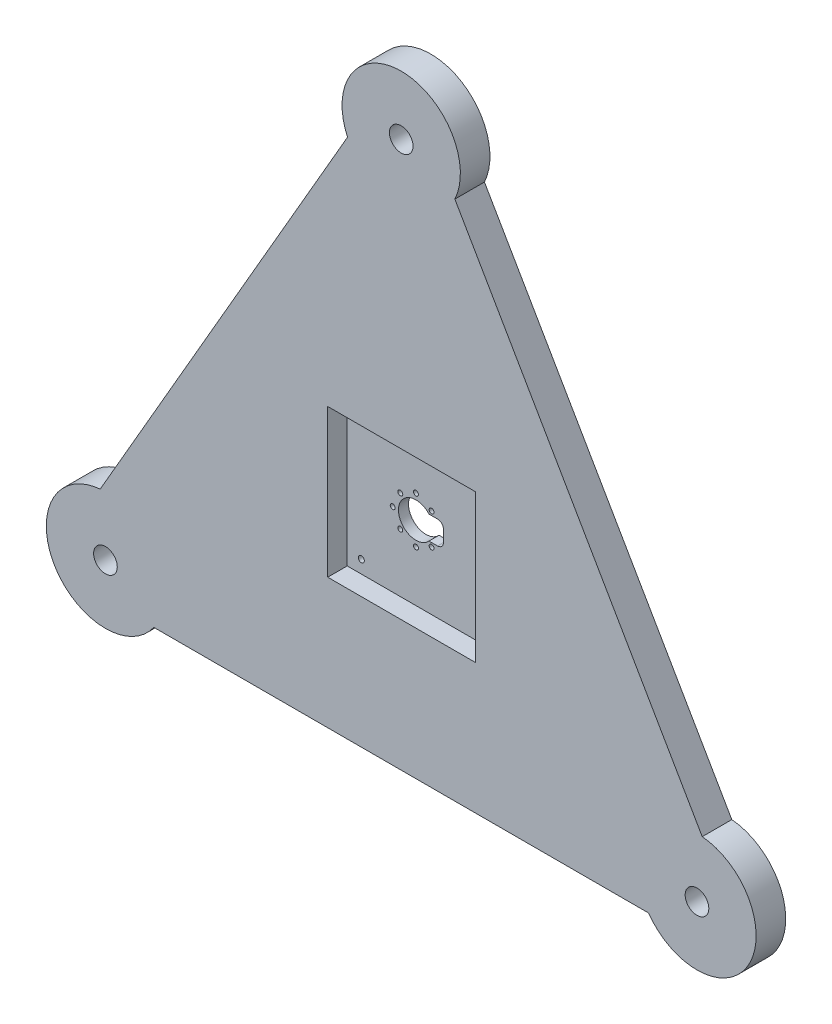
ISO-10303-21;
HEADER;
FILE_DESCRIPTION(('STEP AP214'),'2;1');
FILE_NAME('part.step','',(''),(''),'','','');
FILE_SCHEMA(('AUTOMOTIVE_DESIGN { 1 0 10303 214 1 1 1 1 }'));
ENDSEC;
DATA;
#1=APPLICATION_CONTEXT('core data for automotive mechanical design processes');
#2=APPLICATION_PROTOCOL_DEFINITION('international standard','automotive_design',2000,#1);
#3=PRODUCT_CONTEXT('',#1,'mechanical');
#4=PRODUCT('Part','Part','',(#3));
#5=PRODUCT_RELATED_PRODUCT_CATEGORY('part','',(#4));
#6=PRODUCT_DEFINITION_FORMATION('','',#4);
#7=PRODUCT_DEFINITION_CONTEXT('part definition',#1,'design');
#8=PRODUCT_DEFINITION('design','',#6,#7);
#9=PRODUCT_DEFINITION_SHAPE('','',#8);
#10=(LENGTH_UNIT() NAMED_UNIT(*) SI_UNIT(.MILLI.,.METRE.));
#11=(NAMED_UNIT(*) PLANE_ANGLE_UNIT() SI_UNIT($,.RADIAN.));
#12=(NAMED_UNIT(*) SI_UNIT($,.STERADIAN.) SOLID_ANGLE_UNIT());
#13=UNCERTAINTY_MEASURE_WITH_UNIT(LENGTH_MEASURE(1.E-05),#10,'distance_accuracy_value','');
#14=(GEOMETRIC_REPRESENTATION_CONTEXT(3) GLOBAL_UNCERTAINTY_ASSIGNED_CONTEXT((#13)) GLOBAL_UNIT_ASSIGNED_CONTEXT((#10,
#11,#12)) REPRESENTATION_CONTEXT('',''));
#15=CARTESIAN_POINT('',(0.,0.,0.));
#16=DIRECTION('',(0.,0.,1.));
#17=DIRECTION('',(1.,0.,0.));
#18=AXIS2_PLACEMENT_3D('',#15,#16,#17);
#19=CARTESIAN_POINT('',(0.,0.,0.));
#20=DIRECTION('',(0.,0.,1.));
#21=DIRECTION('',(1.,0.,0.));
#22=AXIS2_PLACEMENT_3D('',#19,#20,#21);
#23=PLANE('',#22);
#24=CARTESIAN_POINT('',(0.,146.646968374165,0.));
#25=DIRECTION('',(0.,0.,1.));
#26=DIRECTION('',(1.,0.,0.));
#27=AXIS2_PLACEMENT_3D('',#24,#25,#26);
#28=CIRCLE('',#27,25.4);
#29=CARTESIAN_POINT('',(23.0384203340171,135.951586730056,0.));
#30=VERTEX_POINT('',#29);
#31=CARTESIAN_POINT('',(-23.038420334017,135.951586730056,0.));
#32=VERTEX_POINT('',#31);
#33=EDGE_CURVE('E377',#30,#32,#28,.T.);
#34=ORIENTED_EDGE('',*,*,#33,.F.);
#35=DIRECTION('',(-0.5,0.866025403784439,0.));
#36=VECTOR('',#35,1.);
#37=CARTESIAN_POINT('',(76.1475791470286,43.9638253186753,0.));
#38=LINE('',#37,#36);
#39=CARTESIAN_POINT('',(129.25673796004,-48.023936092705,0.));
#40=VERTEX_POINT('',#39);
#41=EDGE_CURVE('E388',#40,#30,#38,.T.);
#42=ORIENTED_EDGE('',*,*,#41,.F.);
#43=CARTESIAN_POINT('',(127.,-73.3234841870824,0.));
#44=DIRECTION('',(0.,0.,1.));
#45=DIRECTION('',(1.,0.,0.));
#46=AXIS2_PLACEMENT_3D('',#43,#44,#45);
#47=CIRCLE('',#46,25.4);
#48=CARTESIAN_POINT('',(106.218317626023,-87.9276506373505,0.));
#49=VERTEX_POINT('',#48);
#50=EDGE_CURVE('E386',#49,#40,#47,.T.);
#51=ORIENTED_EDGE('',*,*,#50,.F.);
#52=DIRECTION('',(1.,0.,0.));
#53=VECTOR('',#52,1.);
#54=CARTESIAN_POINT('',(0.,-87.9276506373506,0.));
#55=LINE('',#54,#53);
#56=CARTESIAN_POINT('',(-106.218317626023,-87.9276506373506,0.));
#57=VERTEX_POINT('',#56);
#58=EDGE_CURVE('E384',#57,#49,#55,.T.);
#59=ORIENTED_EDGE('',*,*,#58,.F.);
#60=CARTESIAN_POINT('',(-127.,-73.3234841870825,0.));
#61=DIRECTION('',(0.,0.,1.));
#62=DIRECTION('',(1.,0.,0.));
#63=AXIS2_PLACEMENT_3D('',#60,#61,#62);
#64=CIRCLE('',#63,25.4);
#65=CARTESIAN_POINT('',(-129.25673796004,-48.0239360927051,0.));
#66=VERTEX_POINT('',#65);
#67=EDGE_CURVE('E382',#66,#57,#64,.T.);
#68=ORIENTED_EDGE('',*,*,#67,.F.);
#69=DIRECTION('',(-0.5,-0.866025403784439,0.));
#70=VECTOR('',#69,1.);
#71=CARTESIAN_POINT('',(-76.1475791470286,43.9638253186753,0.));
#72=LINE('',#71,#70);
#73=EDGE_CURVE('E380',#32,#66,#72,.T.);
#74=ORIENTED_EDGE('',*,*,#73,.F.);
#75=EDGE_LOOP('',(#34,#42,#51,#59,#68,#74));
#76=FACE_BOUND('',#75,.T.);
#77=CARTESIAN_POINT('',(127.,-73.3234841870824,0.));
#78=DIRECTION('',(0.,0.,1.));
#79=DIRECTION('',(1.,0.,0.));
#80=AXIS2_PLACEMENT_3D('',#77,#78,#79);
#81=CIRCLE('',#80,5.07999999999999);
#82=CARTESIAN_POINT('',(132.08,-73.3234841870824,0.));
#83=VERTEX_POINT('',#82);
#84=EDGE_CURVE('E341',#83,#83,#81,.T.);
#85=ORIENTED_EDGE('',*,*,#84,.T.);
#86=EDGE_LOOP('',(#85));
#87=FACE_BOUND('',#86,.T.);
#88=CARTESIAN_POINT('',(0.,146.646968374165,0.));
#89=DIRECTION('',(0.,0.,1.));
#90=DIRECTION('',(1.,0.,0.));
#91=AXIS2_PLACEMENT_3D('',#88,#89,#90);
#92=CIRCLE('',#91,5.08);
#93=CARTESIAN_POINT('',(5.08000000000002,146.646968374165,0.));
#94=VERTEX_POINT('',#93);
#95=EDGE_CURVE('E352',#94,#94,#92,.T.);
#96=ORIENTED_EDGE('',*,*,#95,.T.);
#97=EDGE_LOOP('',(#96));
#98=FACE_BOUND('',#97,.T.);
#99=CARTESIAN_POINT('',(-127.,-73.3234841870825,0.));
#100=DIRECTION('',(0.,0.,1.));
#101=DIRECTION('',(1.,0.,0.));
#102=AXIS2_PLACEMENT_3D('',#99,#100,#101);
#103=CIRCLE('',#102,5.08000000000001);
#104=CARTESIAN_POINT('',(-121.92,-73.3234841870825,0.));
#105=VERTEX_POINT('',#104);
#106=EDGE_CURVE('E374',#105,#105,#103,.T.);
#107=ORIENTED_EDGE('',*,*,#106,.T.);
#108=EDGE_LOOP('',(#107));
#109=FACE_BOUND('',#108,.T.);
#110=CARTESIAN_POINT('',(27.2308786567688,-26.4093212941394,0.));
#111=DIRECTION('',(0.,0.,1.));
#112=DIRECTION('',(1.,0.,0.));
#113=AXIS2_PLACEMENT_3D('',#110,#111,#112);
#114=CIRCLE('',#113,1.2954);
#115=CARTESIAN_POINT('',(28.5262786567688,-26.4093212941394,0.));
#116=VERTEX_POINT('',#115);
#117=EDGE_CURVE('E312',#116,#116,#114,.T.);
#118=ORIENTED_EDGE('',*,*,#117,.T.);
#119=EDGE_LOOP('',(#118));
#120=FACE_BOUND('',#119,.T.);
#121=CARTESIAN_POINT('',(-25.5113013418665,-26.4093212941394,0.));
#122=DIRECTION('',(0.,0.,1.));
#123=DIRECTION('',(1.,0.,0.));
#124=AXIS2_PLACEMENT_3D('',#121,#122,#123);
#125=CIRCLE('',#124,1.2954);
#126=CARTESIAN_POINT('',(-24.2159013418666,-26.4093212941394,0.));
#127=VERTEX_POINT('',#126);
#128=EDGE_CURVE('E294',#127,#127,#125,.T.);
#129=ORIENTED_EDGE('',*,*,#128,.T.);
#130=EDGE_LOOP('',(#129));
#131=FACE_BOUND('',#130,.T.);
#132=CARTESIAN_POINT('',(-25.5113013418665,26.803242122524,0.));
#133=DIRECTION('',(0.,0.,1.));
#134=DIRECTION('',(1.,0.,0.));
#135=AXIS2_PLACEMENT_3D('',#132,#133,#134);
#136=CIRCLE('',#135,1.2954);
#137=CARTESIAN_POINT('',(-24.2159013418666,26.803242122524,0.));
#138=VERTEX_POINT('',#137);
#139=EDGE_CURVE('E301',#138,#138,#136,.T.);
#140=ORIENTED_EDGE('',*,*,#139,.T.);
#141=EDGE_LOOP('',(#140));
#142=FACE_BOUND('',#141,.T.);
#143=CARTESIAN_POINT('',(27.2308786567688,26.803242122524,0.));
#144=DIRECTION('',(0.,0.,1.));
#145=DIRECTION('',(1.,0.,0.));
#146=AXIS2_PLACEMENT_3D('',#143,#144,#145);
#147=CIRCLE('',#146,1.2954);
#148=CARTESIAN_POINT('',(28.5262786567688,26.803242122524,0.));
#149=VERTEX_POINT('',#148);
#150=EDGE_CURVE('E307',#149,#149,#147,.T.);
#151=ORIENTED_EDGE('',*,*,#150,.T.);
#152=EDGE_LOOP('',(#151));
#153=FACE_BOUND('',#152,.T.);
#154=CARTESIAN_POINT('',(-8.76888262646258,-6.84713313548926,0.));
#155=DIRECTION('',(0.,0.,1.));
#156=DIRECTION('',(1.,0.,0.));
#157=AXIS2_PLACEMENT_3D('',#154,#155,#156);
#158=CIRCLE('',#157,1.05);
#159=CARTESIAN_POINT('',(-7.71888262646258,-6.84713313548926,0.));
#160=VERTEX_POINT('',#159);
#161=EDGE_CURVE('E274',#160,#160,#158,.T.);
#162=ORIENTED_EDGE('',*,*,#161,.T.);
#163=EDGE_LOOP('',(#162));
#164=FACE_BOUND('',#163,.T.);
#165=CARTESIAN_POINT('',(-2.04888262646258,-10.1271331354893,0.));
#166=DIRECTION('',(0.,0.,1.));
#167=DIRECTION('',(1.,0.,0.));
#168=AXIS2_PLACEMENT_3D('',#165,#166,#167);
#169=CIRCLE('',#168,1.06035135268828);
#170=CARTESIAN_POINT('',(-0.988531273774296,-10.1271331354893,0.));
#171=VERTEX_POINT('',#170);
#172=EDGE_CURVE('E280',#171,#171,#169,.T.);
#173=ORIENTED_EDGE('',*,*,#172,.T.);
#174=EDGE_LOOP('',(#173));
#175=FACE_BOUND('',#174,.T.);
#176=CARTESIAN_POINT('',(4.67111737353742,-6.84713313548926,0.));
#177=DIRECTION('',(0.,0.,1.));
#178=DIRECTION('',(1.,0.,0.));
#179=AXIS2_PLACEMENT_3D('',#176,#177,#178);
#180=CIRCLE('',#179,1.04136685740903);
#181=CARTESIAN_POINT('',(5.71248423094645,-6.84713313548926,0.));
#182=VERTEX_POINT('',#181);
#183=EDGE_CURVE('E286',#182,#182,#180,.T.);
#184=ORIENTED_EDGE('',*,*,#183,.T.);
#185=EDGE_LOOP('',(#184));
#186=FACE_BOUND('',#185,.T.);
#187=CARTESIAN_POINT('',(4.67111737353742,6.59286686451074,0.));
#188=DIRECTION('',(0.,0.,1.));
#189=DIRECTION('',(1.,0.,0.));
#190=AXIS2_PLACEMENT_3D('',#187,#188,#189);
#191=CIRCLE('',#190,1.04547593690891);
#192=CARTESIAN_POINT('',(5.71659331044633,6.59286686451074,0.));
#193=VERTEX_POINT('',#192);
#194=EDGE_CURVE('E263',#193,#193,#191,.T.);
#195=ORIENTED_EDGE('',*,*,#194,.T.);
#196=EDGE_LOOP('',(#195));
#197=FACE_BOUND('',#196,.T.);
#198=CARTESIAN_POINT('',(-2.04888262646258,9.87286686451074,0.));
#199=DIRECTION('',(0.,0.,1.));
#200=DIRECTION('',(1.,0.,0.));
#201=AXIS2_PLACEMENT_3D('',#198,#199,#200);
#202=CIRCLE('',#201,1.05);
#203=CARTESIAN_POINT('',(-0.998882626462577,9.87286686451074,0.));
#204=VERTEX_POINT('',#203);
#205=EDGE_CURVE('E264',#204,#204,#202,.T.);
#206=ORIENTED_EDGE('',*,*,#205,.T.);
#207=EDGE_LOOP('',(#206));
#208=FACE_BOUND('',#207,.T.);
#209=CARTESIAN_POINT('',(-8.76888262646258,6.59286686451074,0.));
#210=DIRECTION('',(0.,0.,1.));
#211=DIRECTION('',(1.,0.,0.));
#212=AXIS2_PLACEMENT_3D('',#209,#210,#211);
#213=CIRCLE('',#212,1.05311333287618);
#214=CARTESIAN_POINT('',(-7.7157692935864,6.59286686451074,0.));
#215=VERTEX_POINT('',#214);
#216=EDGE_CURVE('E251',#215,#215,#213,.T.);
#217=ORIENTED_EDGE('',*,*,#216,.T.);
#218=EDGE_LOOP('',(#217));
#219=FACE_BOUND('',#218,.T.);
#220=CARTESIAN_POINT('',(-12.0488826264626,-0.127133135489261,0.));
#221=DIRECTION('',(0.,0.,1.));
#222=DIRECTION('',(1.,0.,0.));
#223=AXIS2_PLACEMENT_3D('',#220,#221,#222);
#224=CIRCLE('',#223,1.04970270195208);
#225=CARTESIAN_POINT('',(-10.9991799245105,-0.127133135489261,0.));
#226=VERTEX_POINT('',#225);
#227=EDGE_CURVE('E252',#226,#226,#224,.T.);
#228=ORIENTED_EDGE('',*,*,#227,.T.);
#229=EDGE_LOOP('',(#228));
#230=FACE_BOUND('',#229,.T.);
#231=DIRECTION('',(0.,1.,0.));
#232=VECTOR('',#231,1.);
#233=CARTESIAN_POINT('',(3.5412873172869,0.,0.));
#234=LINE('',#233,#232);
#235=CARTESIAN_POINT('',(3.5412873172869,4.87286686451074,0.));
#236=VERTEX_POINT('',#235);
#237=CARTESIAN_POINT('',(3.5412873172869,4.88107236803036,0.));
#238=VERTEX_POINT('',#237);
#239=EDGE_CURVE('E235',#236,#238,#234,.T.);
#240=ORIENTED_EDGE('',*,*,#239,.F.);
#241=CARTESIAN_POINT('',(-2.05420347149077,-0.13189224396157,0.));
#242=DIRECTION('',(0.,0.,1.));
#243=DIRECTION('',(1.,0.,0.));
#244=AXIS2_PLACEMENT_3D('',#241,#242,#243);
#245=CIRCLE('',#244,7.50713866270846);
#246=CARTESIAN_POINT('',(3.54978611957218,-5.12713313548926,0.));
#247=VERTEX_POINT('',#246);
#248=EDGE_CURVE('E229',#236,#247,#245,.T.);
#249=ORIENTED_EDGE('',*,*,#248,.T.);
#250=DIRECTION('',(1.,0.,0.));
#251=VECTOR('',#250,1.);
#252=CARTESIAN_POINT('',(0.,-5.12713313548926,0.));
#253=LINE('',#252,#251);
#254=CARTESIAN_POINT('',(7.21512242016413,-5.12713313548926,0.));
#255=VERTEX_POINT('',#254);
#256=EDGE_CURVE('E100',#247,#255,#253,.T.);
#257=ORIENTED_EDGE('',*,*,#256,.T.);
#258=CARTESIAN_POINT('',(7.21512242016415,-2.58713313548926,0.));
#259=DIRECTION('',(0.,0.,1.));
#260=DIRECTION('',(1.,0.,0.));
#261=AXIS2_PLACEMENT_3D('',#258,#259,#260);
#262=CIRCLE('',#261,2.54);
#263=CARTESIAN_POINT('',(9.75512242016415,-2.58713313548924,0.));
#264=VERTEX_POINT('',#263);
#265=EDGE_CURVE('E216',#255,#264,#262,.T.);
#266=ORIENTED_EDGE('',*,*,#265,.T.);
#267=DIRECTION('',(0.,1.,0.));
#268=VECTOR('',#267,1.);
#269=CARTESIAN_POINT('',(9.75512242016415,0.,0.));
#270=LINE('',#269,#268);
#271=CARTESIAN_POINT('',(9.75512242016415,2.34107236803034,0.));
#272=VERTEX_POINT('',#271);
#273=EDGE_CURVE('E209',#264,#272,#270,.T.);
#274=ORIENTED_EDGE('',*,*,#273,.T.);
#275=CARTESIAN_POINT('',(7.21512242016415,2.34107236803036,0.));
#276=DIRECTION('',(0.,0.,1.));
#277=DIRECTION('',(1.,0.,0.));
#278=AXIS2_PLACEMENT_3D('',#275,#276,#277);
#279=CIRCLE('',#278,2.54);
#280=CARTESIAN_POINT('',(7.21512242016413,4.88107236803036,0.));
#281=VERTEX_POINT('',#280);
#282=EDGE_CURVE('E220',#272,#281,#279,.T.);
#283=ORIENTED_EDGE('',*,*,#282,.T.);
#284=DIRECTION('',(1.,0.,0.));
#285=VECTOR('',#284,1.);
#286=CARTESIAN_POINT('',(0.,4.88107236803036,0.));
#287=LINE('',#286,#285);
#288=EDGE_CURVE('E225',#238,#281,#287,.T.);
#289=ORIENTED_EDGE('',*,*,#288,.F.);
#290=EDGE_LOOP('',(#240,#249,#257,#266,#274,#283,#289));
#291=FACE_BOUND('',#290,.T.);
#292=ADVANCED_FACE('F85',(#76,#87,#98,#109,#120,#131,#142,#153,#164,#175,#186,#197,#208,#219,
#230,#291),#23,.F.);
#293=CARTESIAN_POINT('',(0.,0.,4.318));
#294=DIRECTION('',(0.,0.,-1.));
#295=DIRECTION('',(-1.,0.,0.));
#296=AXIS2_PLACEMENT_3D('',#293,#294,#295);
#297=PLANE('',#296);
#298=DIRECTION('',(1.,0.,0.));
#299=VECTOR('',#298,1.);
#300=CARTESIAN_POINT('',(-31.5586241972298,-31.9413758027702,4.318));
#301=LINE('',#300,#299);
#302=CARTESIAN_POINT('',(-31.5586241972298,-31.9413758027702,4.318));
#303=VERTEX_POINT('',#302);
#304=CARTESIAN_POINT('',(31.9413758027702,-31.9413758027702,4.318));
#305=VERTEX_POINT('',#304);
#306=EDGE_CURVE('E318',#303,#305,#301,.T.);
#307=ORIENTED_EDGE('',*,*,#306,.T.);
#308=DIRECTION('',(0.,-1.,0.));
#309=VECTOR('',#308,1.);
#310=CARTESIAN_POINT('',(31.9413758027702,31.5586241972298,4.318));
#311=LINE('',#310,#309);
#312=CARTESIAN_POINT('',(31.9413758027702,31.5586241972298,4.318));
#313=VERTEX_POINT('',#312);
#314=EDGE_CURVE('E321',#313,#305,#311,.T.);
#315=ORIENTED_EDGE('',*,*,#314,.F.);
#316=DIRECTION('',(1.,0.,0.));
#317=VECTOR('',#316,1.);
#318=CARTESIAN_POINT('',(-31.5586241972298,31.5586241972298,4.318));
#319=LINE('',#318,#317);
#320=CARTESIAN_POINT('',(-31.5586241972298,31.5586241972298,4.318));
#321=VERTEX_POINT('',#320);
#322=EDGE_CURVE('E324',#321,#313,#319,.T.);
#323=ORIENTED_EDGE('',*,*,#322,.F.);
#324=DIRECTION('',(0.,-1.,0.));
#325=VECTOR('',#324,1.);
#326=CARTESIAN_POINT('',(-31.5586241972298,31.5586241972298,4.318));
#327=LINE('',#326,#325);
#328=EDGE_CURVE('E326',#321,#303,#327,.T.);
#329=ORIENTED_EDGE('',*,*,#328,.T.);
#330=EDGE_LOOP('',(#307,#315,#323,#329));
#331=FACE_BOUND('',#330,.T.);
#332=CARTESIAN_POINT('',(27.2308786567688,-26.4093212941394,4.318));
#333=DIRECTION('',(0.,0.,1.));
#334=DIRECTION('',(1.,0.,0.));
#335=AXIS2_PLACEMENT_3D('',#332,#333,#334);
#336=CIRCLE('',#335,1.2954);
#337=CARTESIAN_POINT('',(28.5262786567688,-26.4093212941394,4.318));
#338=VERTEX_POINT('',#337);
#339=EDGE_CURVE('E297',#338,#338,#336,.T.);
#340=ORIENTED_EDGE('',*,*,#339,.F.);
#341=EDGE_LOOP('',(#340));
#342=FACE_BOUND('',#341,.T.);
#343=CARTESIAN_POINT('',(-25.5113013418665,-26.4093212941394,4.318));
#344=DIRECTION('',(0.,0.,1.));
#345=DIRECTION('',(1.,0.,0.));
#346=AXIS2_PLACEMENT_3D('',#343,#344,#345);
#347=CIRCLE('',#346,1.2954);
#348=CARTESIAN_POINT('',(-24.2159013418666,-26.4093212941394,4.318));
#349=VERTEX_POINT('',#348);
#350=EDGE_CURVE('E298',#349,#349,#347,.T.);
#351=ORIENTED_EDGE('',*,*,#350,.F.);
#352=EDGE_LOOP('',(#351));
#353=FACE_BOUND('',#352,.T.);
#354=CARTESIAN_POINT('',(-25.5113013418665,26.803242122524,4.318));
#355=DIRECTION('',(0.,0.,1.));
#356=DIRECTION('',(1.,0.,0.));
#357=AXIS2_PLACEMENT_3D('',#354,#355,#356);
#358=CIRCLE('',#357,1.2954);
#359=CARTESIAN_POINT('',(-24.2159013418666,26.803242122524,4.318));
#360=VERTEX_POINT('',#359);
#361=EDGE_CURVE('E304',#360,#360,#358,.T.);
#362=ORIENTED_EDGE('',*,*,#361,.F.);
#363=EDGE_LOOP('',(#362));
#364=FACE_BOUND('',#363,.T.);
#365=CARTESIAN_POINT('',(27.2308786567688,26.803242122524,4.318));
#366=DIRECTION('',(0.,0.,1.));
#367=DIRECTION('',(1.,0.,0.));
#368=AXIS2_PLACEMENT_3D('',#365,#366,#367);
#369=CIRCLE('',#368,1.2954);
#370=CARTESIAN_POINT('',(28.5262786567688,26.803242122524,4.318));
#371=VERTEX_POINT('',#370);
#372=EDGE_CURVE('E255',#371,#371,#369,.T.);
#373=ORIENTED_EDGE('',*,*,#372,.F.);
#374=EDGE_LOOP('',(#373));
#375=FACE_BOUND('',#374,.T.);
#376=CARTESIAN_POINT('',(-8.76888262646258,-6.84713313548926,4.318));
#377=DIRECTION('',(0.,0.,1.));
#378=DIRECTION('',(1.,0.,0.));
#379=AXIS2_PLACEMENT_3D('',#376,#377,#378);
#380=CIRCLE('',#379,1.05);
#381=CARTESIAN_POINT('',(-7.71888262646258,-6.84713313548926,4.318));
#382=VERTEX_POINT('',#381);
#383=EDGE_CURVE('E259',#382,#382,#380,.T.);
#384=ORIENTED_EDGE('',*,*,#383,.F.);
#385=EDGE_LOOP('',(#384));
#386=FACE_BOUND('',#385,.T.);
#387=CARTESIAN_POINT('',(-2.04888262646258,-10.1271331354893,4.318));
#388=DIRECTION('',(0.,0.,1.));
#389=DIRECTION('',(1.,0.,0.));
#390=AXIS2_PLACEMENT_3D('',#387,#388,#389);
#391=CIRCLE('',#390,1.06035135268828);
#392=CARTESIAN_POINT('',(-0.988531273774296,-10.1271331354893,4.318));
#393=VERTEX_POINT('',#392);
#394=EDGE_CURVE('E277',#393,#393,#391,.T.);
#395=ORIENTED_EDGE('',*,*,#394,.F.);
#396=EDGE_LOOP('',(#395));
#397=FACE_BOUND('',#396,.T.);
#398=CARTESIAN_POINT('',(4.67111737353742,-6.84713313548926,4.318));
#399=DIRECTION('',(0.,0.,1.));
#400=DIRECTION('',(1.,0.,0.));
#401=AXIS2_PLACEMENT_3D('',#398,#399,#400);
#402=CIRCLE('',#401,1.04136685740903);
#403=CARTESIAN_POINT('',(5.71248423094645,-6.84713313548926,4.318));
#404=VERTEX_POINT('',#403);
#405=EDGE_CURVE('E283',#404,#404,#402,.T.);
#406=ORIENTED_EDGE('',*,*,#405,.F.);
#407=EDGE_LOOP('',(#406));
#408=FACE_BOUND('',#407,.T.);
#409=CARTESIAN_POINT('',(4.67111737353742,6.59286686451074,4.318));
#410=DIRECTION('',(0.,0.,1.));
#411=DIRECTION('',(1.,0.,0.));
#412=AXIS2_PLACEMENT_3D('',#409,#410,#411);
#413=CIRCLE('',#412,1.04547593690891);
#414=CARTESIAN_POINT('',(5.71659331044633,6.59286686451074,4.318));
#415=VERTEX_POINT('',#414);
#416=EDGE_CURVE('E289',#415,#415,#413,.T.);
#417=ORIENTED_EDGE('',*,*,#416,.F.);
#418=EDGE_LOOP('',(#417));
#419=FACE_BOUND('',#418,.T.);
#420=CARTESIAN_POINT('',(-2.04888262646258,9.87286686451074,4.318));
#421=DIRECTION('',(0.,0.,1.));
#422=DIRECTION('',(1.,0.,0.));
#423=AXIS2_PLACEMENT_3D('',#420,#421,#422);
#424=CIRCLE('',#423,1.05);
#425=CARTESIAN_POINT('',(-0.998882626462577,9.87286686451074,4.318));
#426=VERTEX_POINT('',#425);
#427=EDGE_CURVE('E260',#426,#426,#424,.T.);
#428=ORIENTED_EDGE('',*,*,#427,.F.);
#429=EDGE_LOOP('',(#428));
#430=FACE_BOUND('',#429,.T.);
#431=CARTESIAN_POINT('',(-8.76888262646258,6.59286686451074,4.318));
#432=DIRECTION('',(0.,0.,1.));
#433=DIRECTION('',(1.,0.,0.));
#434=AXIS2_PLACEMENT_3D('',#431,#432,#433);
#435=CIRCLE('',#434,1.05311333287618);
#436=CARTESIAN_POINT('',(-7.7157692935864,6.59286686451074,4.318));
#437=VERTEX_POINT('',#436);
#438=EDGE_CURVE('E267',#437,#437,#435,.T.);
#439=ORIENTED_EDGE('',*,*,#438,.F.);
#440=EDGE_LOOP('',(#439));
#441=FACE_BOUND('',#440,.T.);
#442=CARTESIAN_POINT('',(-12.0488826264626,-0.127133135489261,4.318));
#443=DIRECTION('',(0.,0.,1.));
#444=DIRECTION('',(1.,0.,0.));
#445=AXIS2_PLACEMENT_3D('',#442,#443,#444);
#446=CIRCLE('',#445,1.04970270195208);
#447=CARTESIAN_POINT('',(-10.9991799245105,-0.127133135489261,4.318));
#448=VERTEX_POINT('',#447);
#449=EDGE_CURVE('E256',#448,#448,#446,.T.);
#450=ORIENTED_EDGE('',*,*,#449,.F.);
#451=EDGE_LOOP('',(#450));
#452=FACE_BOUND('',#451,.T.);
#453=DIRECTION('',(0.,-1.,0.));
#454=VECTOR('',#453,1.);
#455=CARTESIAN_POINT('',(3.5412873172869,0.,4.318));
#456=LINE('',#455,#454);
#457=CARTESIAN_POINT('',(3.5412873172869,4.88107236803036,4.318));
#458=VERTEX_POINT('',#457);
#459=CARTESIAN_POINT('',(3.5412873172869,4.87286686451074,4.318));
#460=VERTEX_POINT('',#459);
#461=EDGE_CURVE('E12',#458,#460,#456,.T.);
#462=ORIENTED_EDGE('',*,*,#461,.F.);
#463=DIRECTION('',(-1.,0.,0.));
#464=VECTOR('',#463,1.);
#465=CARTESIAN_POINT('',(0.,4.88107236803036,4.318));
#466=LINE('',#465,#464);
#467=CARTESIAN_POINT('',(7.21512242016413,4.88107236803036,4.318));
#468=VERTEX_POINT('',#467);
#469=EDGE_CURVE('E93',#468,#458,#466,.T.);
#470=ORIENTED_EDGE('',*,*,#469,.F.);
#471=CARTESIAN_POINT('',(7.21512242016415,2.34107236803036,4.318));
#472=DIRECTION('',(0.,0.,-1.));
#473=DIRECTION('',(-1.,0.,0.));
#474=AXIS2_PLACEMENT_3D('',#471,#472,#473);
#475=CIRCLE('',#474,2.54);
#476=CARTESIAN_POINT('',(9.75512242016415,2.34107236803034,4.318));
#477=VERTEX_POINT('',#476);
#478=EDGE_CURVE('E419',#468,#477,#475,.T.);
#479=ORIENTED_EDGE('',*,*,#478,.T.);
#480=DIRECTION('',(0.,-1.,0.));
#481=VECTOR('',#480,1.);
#482=CARTESIAN_POINT('',(9.75512242016415,0.,4.318));
#483=LINE('',#482,#481);
#484=CARTESIAN_POINT('',(9.75512242016415,-2.58713313548924,4.318));
#485=VERTEX_POINT('',#484);
#486=EDGE_CURVE('E212',#477,#485,#483,.T.);
#487=ORIENTED_EDGE('',*,*,#486,.T.);
#488=CARTESIAN_POINT('',(7.21512242016415,-2.58713313548926,4.318));
#489=DIRECTION('',(0.,0.,-1.));
#490=DIRECTION('',(-1.,0.,0.));
#491=AXIS2_PLACEMENT_3D('',#488,#489,#490);
#492=CIRCLE('',#491,2.54);
#493=CARTESIAN_POINT('',(7.21512242016413,-5.12713313548926,4.318));
#494=VERTEX_POINT('',#493);
#495=EDGE_CURVE('E415',#485,#494,#492,.T.);
#496=ORIENTED_EDGE('',*,*,#495,.T.);
#497=DIRECTION('',(-1.,0.,0.));
#498=VECTOR('',#497,1.);
#499=CARTESIAN_POINT('',(0.,-5.12713313548926,4.318));
#500=LINE('',#499,#498);
#501=CARTESIAN_POINT('',(3.54978611957218,-5.12713313548926,4.318));
#502=VERTEX_POINT('',#501);
#503=EDGE_CURVE('E412',#494,#502,#500,.T.);
#504=ORIENTED_EDGE('',*,*,#503,.T.);
#505=CARTESIAN_POINT('',(-2.05420347149077,-0.13189224396157,4.318));
#506=DIRECTION('',(0.,0.,-1.));
#507=DIRECTION('',(-1.,0.,0.));
#508=AXIS2_PLACEMENT_3D('',#505,#506,#507);
#509=CIRCLE('',#508,7.50713866270846);
#510=EDGE_CURVE('E409',#502,#460,#509,.T.);
#511=ORIENTED_EDGE('',*,*,#510,.T.);
#512=EDGE_LOOP('',(#462,#470,#479,#487,#496,#504,#511));
#513=FACE_BOUND('',#512,.T.);
#514=ADVANCED_FACE('F428',(#331,#342,#353,#364,#375,#386,#397,#408,#419,#430,#441,#452,#513),
#297,.F.);
#515=CARTESIAN_POINT('',(0.,0.,12.7));
#516=DIRECTION('',(0.,0.,1.));
#517=DIRECTION('',(1.,0.,0.));
#518=AXIS2_PLACEMENT_3D('',#515,#516,#517);
#519=PLANE('',#518);
#520=CARTESIAN_POINT('',(-127.,-73.3234841870825,12.7));
#521=DIRECTION('',(0.,0.,1.));
#522=DIRECTION('',(1.,0.,0.));
#523=AXIS2_PLACEMENT_3D('',#520,#521,#522);
#524=CIRCLE('',#523,5.08000000000001);
#525=CARTESIAN_POINT('',(-121.92,-73.3234841870825,12.7));
#526=VERTEX_POINT('',#525);
#527=EDGE_CURVE('E351',#526,#526,#524,.T.);
#528=ORIENTED_EDGE('',*,*,#527,.F.);
#529=EDGE_LOOP('',(#528));
#530=FACE_BOUND('',#529,.T.);
#531=DIRECTION('',(1.,0.,0.));
#532=VECTOR('',#531,1.);
#533=CARTESIAN_POINT('',(-31.5586241972298,-31.9413758027702,12.7));
#534=LINE('',#533,#532);
#535=CARTESIAN_POINT('',(-31.5586241972298,-31.9413758027702,12.7));
#536=VERTEX_POINT('',#535);
#537=CARTESIAN_POINT('',(31.9413758027702,-31.9413758027702,12.7));
#538=VERTEX_POINT('',#537);
#539=EDGE_CURVE('E315',#536,#538,#534,.T.);
#540=ORIENTED_EDGE('',*,*,#539,.F.);
#541=DIRECTION('',(0.,-1.,0.));
#542=VECTOR('',#541,1.);
#543=CARTESIAN_POINT('',(-31.5586241972298,31.5586241972298,12.7));
#544=LINE('',#543,#542);
#545=CARTESIAN_POINT('',(-31.5586241972298,31.5586241972298,12.7));
#546=VERTEX_POINT('',#545);
#547=EDGE_CURVE('E322',#546,#536,#544,.T.);
#548=ORIENTED_EDGE('',*,*,#547,.F.);
#549=DIRECTION('',(1.,0.,0.));
#550=VECTOR('',#549,1.);
#551=CARTESIAN_POINT('',(-31.5586241972298,31.5586241972298,12.7));
#552=LINE('',#551,#550);
#553=CARTESIAN_POINT('',(31.9413758027702,31.5586241972298,12.7));
#554=VERTEX_POINT('',#553);
#555=EDGE_CURVE('E334',#546,#554,#552,.T.);
#556=ORIENTED_EDGE('',*,*,#555,.T.);
#557=DIRECTION('',(0.,-1.,0.));
#558=VECTOR('',#557,1.);
#559=CARTESIAN_POINT('',(31.9413758027702,31.5586241972298,12.7));
#560=LINE('',#559,#558);
#561=EDGE_CURVE('E331',#554,#538,#560,.T.);
#562=ORIENTED_EDGE('',*,*,#561,.T.);
#563=EDGE_LOOP('',(#540,#548,#556,#562));
#564=FACE_BOUND('',#563,.T.);
#565=CARTESIAN_POINT('',(0.,146.646968374165,12.7));
#566=DIRECTION('',(0.,0.,1.));
#567=DIRECTION('',(1.,0.,0.));
#568=AXIS2_PLACEMENT_3D('',#565,#566,#567);
#569=CIRCLE('',#568,5.08);
#570=CARTESIAN_POINT('',(5.08000000000002,146.646968374165,12.7));
#571=VERTEX_POINT('',#570);
#572=EDGE_CURVE('E368',#571,#571,#569,.T.);
#573=ORIENTED_EDGE('',*,*,#572,.F.);
#574=EDGE_LOOP('',(#573));
#575=FACE_BOUND('',#574,.T.);
#576=CARTESIAN_POINT('',(127.,-73.3234841870824,12.7));
#577=DIRECTION('',(0.,0.,1.));
#578=DIRECTION('',(1.,0.,0.));
#579=AXIS2_PLACEMENT_3D('',#576,#577,#578);
#580=CIRCLE('',#579,5.07999999999999);
#581=CARTESIAN_POINT('',(132.08,-73.3234841870824,12.7));
#582=VERTEX_POINT('',#581);
#583=EDGE_CURVE('E348',#582,#582,#580,.T.);
#584=ORIENTED_EDGE('',*,*,#583,.F.);
#585=EDGE_LOOP('',(#584));
#586=FACE_BOUND('',#585,.T.);
#587=CARTESIAN_POINT('',(0.,146.646968374165,12.7));
#588=DIRECTION('',(0.,0.,1.));
#589=DIRECTION('',(1.,0.,0.));
#590=AXIS2_PLACEMENT_3D('',#587,#588,#589);
#591=CIRCLE('',#590,25.4);
#592=CARTESIAN_POINT('',(23.0384203340171,135.951586730056,12.7));
#593=VERTEX_POINT('',#592);
#594=CARTESIAN_POINT('',(-23.038420334017,135.951586730056,12.7));
#595=VERTEX_POINT('',#594);
#596=EDGE_CURVE('E355',#593,#595,#591,.T.);
#597=ORIENTED_EDGE('',*,*,#596,.T.);
#598=DIRECTION('',(-0.5,-0.866025403784439,0.));
#599=VECTOR('',#598,1.);
#600=CARTESIAN_POINT('',(-76.1475791470286,43.9638253186753,12.7));
#601=LINE('',#600,#599);
#602=CARTESIAN_POINT('',(-129.25673796004,-48.0239360927051,12.7));
#603=VERTEX_POINT('',#602);
#604=EDGE_CURVE('E358',#595,#603,#601,.T.);
#605=ORIENTED_EDGE('',*,*,#604,.T.);
#606=CARTESIAN_POINT('',(-127.,-73.3234841870825,12.7));
#607=DIRECTION('',(0.,0.,1.));
#608=DIRECTION('',(1.,0.,0.));
#609=AXIS2_PLACEMENT_3D('',#606,#607,#608);
#610=CIRCLE('',#609,25.4);
#611=CARTESIAN_POINT('',(-106.218317626023,-87.9276506373506,12.7));
#612=VERTEX_POINT('',#611);
#613=EDGE_CURVE('E360',#603,#612,#610,.T.);
#614=ORIENTED_EDGE('',*,*,#613,.T.);
#615=DIRECTION('',(1.,0.,0.));
#616=VECTOR('',#615,1.);
#617=CARTESIAN_POINT('',(0.,-87.9276506373506,12.7));
#618=LINE('',#617,#616);
#619=CARTESIAN_POINT('',(106.218317626023,-87.9276506373505,12.7));
#620=VERTEX_POINT('',#619);
#621=EDGE_CURVE('E362',#612,#620,#618,.T.);
#622=ORIENTED_EDGE('',*,*,#621,.T.);
#623=CARTESIAN_POINT('',(127.,-73.3234841870824,12.7));
#624=DIRECTION('',(0.,0.,1.));
#625=DIRECTION('',(1.,0.,0.));
#626=AXIS2_PLACEMENT_3D('',#623,#624,#625);
#627=CIRCLE('',#626,25.4);
#628=CARTESIAN_POINT('',(129.25673796004,-48.023936092705,12.7));
#629=VERTEX_POINT('',#628);
#630=EDGE_CURVE('E364',#620,#629,#627,.T.);
#631=ORIENTED_EDGE('',*,*,#630,.T.);
#632=DIRECTION('',(-0.5,0.866025403784439,0.));
#633=VECTOR('',#632,1.);
#634=CARTESIAN_POINT('',(76.1475791470286,43.9638253186753,12.7));
#635=LINE('',#634,#633);
#636=EDGE_CURVE('E366',#629,#593,#635,.T.);
#637=ORIENTED_EDGE('',*,*,#636,.T.);
#638=EDGE_LOOP('',(#597,#605,#614,#622,#631,#637));
#639=FACE_BOUND('',#638,.T.);
#640=ADVANCED_FACE('F447',(#530,#564,#575,#586,#639),#519,.T.);
#641=CARTESIAN_POINT('',(127.,-73.3234841870824,12.7));
#642=DIRECTION('',(0.,0.,-1.));
#643=DIRECTION('',(-1.,0.,0.));
#644=AXIS2_PLACEMENT_3D('',#641,#642,#643);
#645=CYLINDRICAL_SURFACE('',#644,5.07999999999999);
#646=ORIENTED_EDGE('',*,*,#84,.F.);
#647=EDGE_LOOP('',(#646));
#648=FACE_BOUND('',#647,.T.);
#649=ORIENTED_EDGE('',*,*,#583,.T.);
#650=EDGE_LOOP('',(#649));
#651=FACE_BOUND('',#650,.T.);
#652=ADVANCED_FACE('F87',(#648,#651),#645,.F.);
#653=CARTESIAN_POINT('',(-127.,-73.3234841870825,12.7));
#654=DIRECTION('',(0.,0.,-1.));
#655=DIRECTION('',(-1.,0.,0.));
#656=AXIS2_PLACEMENT_3D('',#653,#654,#655);
#657=CYLINDRICAL_SURFACE('',#656,5.08000000000001);
#658=ORIENTED_EDGE('',*,*,#106,.F.);
#659=EDGE_LOOP('',(#658));
#660=FACE_BOUND('',#659,.T.);
#661=ORIENTED_EDGE('',*,*,#527,.T.);
#662=EDGE_LOOP('',(#661));
#663=FACE_BOUND('',#662,.T.);
#664=ADVANCED_FACE('F459',(#660,#663),#657,.F.);
#665=CARTESIAN_POINT('',(0.,146.646968374165,12.7));
#666=DIRECTION('',(0.,0.,-1.));
#667=DIRECTION('',(-1.,0.,0.));
#668=AXIS2_PLACEMENT_3D('',#665,#666,#667);
#669=CYLINDRICAL_SURFACE('',#668,5.08);
#670=ORIENTED_EDGE('',*,*,#572,.T.);
#671=EDGE_LOOP('',(#670));
#672=FACE_BOUND('',#671,.T.);
#673=ORIENTED_EDGE('',*,*,#95,.F.);
#674=EDGE_LOOP('',(#673));
#675=FACE_BOUND('',#674,.T.);
#676=ADVANCED_FACE('F455',(#672,#675),#669,.F.);
#677=CARTESIAN_POINT('',(-76.1475791470286,43.9638253186753,12.7));
#678=DIRECTION('',(0.866025403784439,-0.5,0.));
#679=DIRECTION('',(0.5,0.866025403784439,0.));
#680=AXIS2_PLACEMENT_3D('',#677,#678,#679);
#681=PLANE('',#680);
#682=ORIENTED_EDGE('',*,*,#73,.T.);
#683=DIRECTION('',(0.,0.,-1.));
#684=VECTOR('',#683,1.);
#685=CARTESIAN_POINT('',(-129.25673796004,-48.0239360927051,12.7));
#686=LINE('',#685,#684);
#687=EDGE_CURVE('E403',#603,#66,#686,.T.);
#688=ORIENTED_EDGE('',*,*,#687,.F.);
#689=ORIENTED_EDGE('',*,*,#604,.F.);
#690=DIRECTION('',(0.,0.,-1.));
#691=VECTOR('',#690,1.);
#692=CARTESIAN_POINT('',(-23.038420334017,135.951586730056,12.7));
#693=LINE('',#692,#691);
#694=EDGE_CURVE('E406',#595,#32,#693,.T.);
#695=ORIENTED_EDGE('',*,*,#694,.T.);
#696=EDGE_LOOP('',(#682,#688,#689,#695));
#697=FACE_BOUND('',#696,.T.);
#698=ADVANCED_FACE('F458',(#697),#681,.F.);
#699=CARTESIAN_POINT('',(-127.,-73.3234841870825,12.7));
#700=DIRECTION('',(0.,0.,-1.));
#701=DIRECTION('',(-1.,0.,0.));
#702=AXIS2_PLACEMENT_3D('',#699,#700,#701);
#703=CYLINDRICAL_SURFACE('',#702,25.4);
#704=ORIENTED_EDGE('',*,*,#67,.T.);
#705=DIRECTION('',(0.,0.,-1.));
#706=VECTOR('',#705,1.);
#707=CARTESIAN_POINT('',(-106.218317626023,-87.9276506373506,12.7));
#708=LINE('',#707,#706);
#709=EDGE_CURVE('E400',#612,#57,#708,.T.);
#710=ORIENTED_EDGE('',*,*,#709,.F.);
#711=ORIENTED_EDGE('',*,*,#613,.F.);
#712=ORIENTED_EDGE('',*,*,#687,.T.);
#713=EDGE_LOOP('',(#704,#710,#711,#712));
#714=FACE_BOUND('',#713,.T.);
#715=ADVANCED_FACE('F473',(#714),#703,.T.);
#716=CARTESIAN_POINT('',(0.,-87.9276506373506,12.7));
#717=DIRECTION('',(0.,1.,0.));
#718=DIRECTION('',(-1.,0.,0.));
#719=AXIS2_PLACEMENT_3D('',#716,#717,#718);
#720=PLANE('',#719);
#721=ORIENTED_EDGE('',*,*,#58,.T.);
#722=DIRECTION('',(0.,0.,-1.));
#723=VECTOR('',#722,1.);
#724=CARTESIAN_POINT('',(106.218317626023,-87.9276506373505,12.7));
#725=LINE('',#724,#723);
#726=EDGE_CURVE('E397',#620,#49,#725,.T.);
#727=ORIENTED_EDGE('',*,*,#726,.F.);
#728=ORIENTED_EDGE('',*,*,#621,.F.);
#729=ORIENTED_EDGE('',*,*,#709,.T.);
#730=EDGE_LOOP('',(#721,#727,#728,#729));
#731=FACE_BOUND('',#730,.T.);
#732=ADVANCED_FACE('F469',(#731),#720,.F.);
#733=CARTESIAN_POINT('',(127.,-73.3234841870824,12.7));
#734=DIRECTION('',(0.,0.,-1.));
#735=DIRECTION('',(-1.,0.,0.));
#736=AXIS2_PLACEMENT_3D('',#733,#734,#735);
#737=CYLINDRICAL_SURFACE('',#736,25.4);
#738=ORIENTED_EDGE('',*,*,#50,.T.);
#739=DIRECTION('',(0.,0.,-1.));
#740=VECTOR('',#739,1.);
#741=CARTESIAN_POINT('',(129.25673796004,-48.023936092705,12.7));
#742=LINE('',#741,#740);
#743=EDGE_CURVE('E394',#629,#40,#742,.T.);
#744=ORIENTED_EDGE('',*,*,#743,.F.);
#745=ORIENTED_EDGE('',*,*,#630,.F.);
#746=ORIENTED_EDGE('',*,*,#726,.T.);
#747=EDGE_LOOP('',(#738,#744,#745,#746));
#748=FACE_BOUND('',#747,.T.);
#749=ADVANCED_FACE('F465',(#748),#737,.T.);
#750=CARTESIAN_POINT('',(76.1475791470286,43.9638253186753,12.7));
#751=DIRECTION('',(-0.866025403784439,-0.5,0.));
#752=DIRECTION('',(0.5,-0.866025403784439,0.));
#753=AXIS2_PLACEMENT_3D('',#750,#751,#752);
#754=PLANE('',#753);
#755=ORIENTED_EDGE('',*,*,#41,.T.);
#756=DIRECTION('',(0.,0.,-1.));
#757=VECTOR('',#756,1.);
#758=CARTESIAN_POINT('',(23.0384203340171,135.951586730056,12.7));
#759=LINE('',#758,#757);
#760=EDGE_CURVE('E371',#593,#30,#759,.T.);
#761=ORIENTED_EDGE('',*,*,#760,.F.);
#762=ORIENTED_EDGE('',*,*,#636,.F.);
#763=ORIENTED_EDGE('',*,*,#743,.T.);
#764=EDGE_LOOP('',(#755,#761,#762,#763));
#765=FACE_BOUND('',#764,.T.);
#766=ADVANCED_FACE('F461',(#765),#754,.F.);
#767=CARTESIAN_POINT('',(0.,146.646968374165,12.7));
#768=DIRECTION('',(0.,0.,-1.));
#769=DIRECTION('',(-1.,0.,0.));
#770=AXIS2_PLACEMENT_3D('',#767,#768,#769);
#771=CYLINDRICAL_SURFACE('',#770,25.4);
#772=ORIENTED_EDGE('',*,*,#33,.T.);
#773=ORIENTED_EDGE('',*,*,#694,.F.);
#774=ORIENTED_EDGE('',*,*,#596,.F.);
#775=ORIENTED_EDGE('',*,*,#760,.T.);
#776=EDGE_LOOP('',(#772,#773,#774,#775));
#777=FACE_BOUND('',#776,.T.);
#778=ADVANCED_FACE('F464',(#777),#771,.T.);
#779=CARTESIAN_POINT('',(-31.5586241972298,-31.9413758027702,4.318));
#780=DIRECTION('',(0.,-1.,0.));
#781=DIRECTION('',(1.,0.,0.));
#782=AXIS2_PLACEMENT_3D('',#779,#780,#781);
#783=PLANE('',#782);
#784=ORIENTED_EDGE('',*,*,#539,.T.);
#785=DIRECTION('',(0.,0.,1.));
#786=VECTOR('',#785,1.);
#787=CARTESIAN_POINT('',(31.9413758027702,-31.9413758027702,4.318));
#788=LINE('',#787,#786);
#789=EDGE_CURVE('E329',#305,#538,#788,.T.);
#790=ORIENTED_EDGE('',*,*,#789,.F.);
#791=ORIENTED_EDGE('',*,*,#306,.F.);
#792=DIRECTION('',(0.,0.,1.));
#793=VECTOR('',#792,1.);
#794=CARTESIAN_POINT('',(-31.5586241972298,-31.9413758027702,4.318));
#795=LINE('',#794,#793);
#796=EDGE_CURVE('E339',#303,#536,#795,.T.);
#797=ORIENTED_EDGE('',*,*,#796,.T.);
#798=EDGE_LOOP('',(#784,#790,#791,#797));
#799=FACE_BOUND('',#798,.T.);
#800=ADVANCED_FACE('F482',(#799),#783,.F.);
#801=CARTESIAN_POINT('',(-31.5586241972298,31.5586241972298,4.318));
#802=DIRECTION('',(-1.,0.,0.));
#803=DIRECTION('',(0.,-1.,0.));
#804=AXIS2_PLACEMENT_3D('',#801,#802,#803);
#805=PLANE('',#804);
#806=ORIENTED_EDGE('',*,*,#547,.T.);
#807=ORIENTED_EDGE('',*,*,#796,.F.);
#808=ORIENTED_EDGE('',*,*,#328,.F.);
#809=DIRECTION('',(0.,0.,1.));
#810=VECTOR('',#809,1.);
#811=CARTESIAN_POINT('',(-31.5586241972298,31.5586241972298,4.318));
#812=LINE('',#811,#810);
#813=EDGE_CURVE('E342',#321,#546,#812,.T.);
#814=ORIENTED_EDGE('',*,*,#813,.T.);
#815=EDGE_LOOP('',(#806,#807,#808,#814));
#816=FACE_BOUND('',#815,.T.);
#817=ADVANCED_FACE('F599',(#816),#805,.F.);
#818=CARTESIAN_POINT('',(-31.5586241972298,31.5586241972298,4.318));
#819=DIRECTION('',(0.,-1.,0.));
#820=DIRECTION('',(0.,0.,-1.));
#821=AXIS2_PLACEMENT_3D('',#818,#819,#820);
#822=PLANE('',#821);
#823=ORIENTED_EDGE('',*,*,#555,.F.);
#824=ORIENTED_EDGE('',*,*,#813,.F.);
#825=ORIENTED_EDGE('',*,*,#322,.T.);
#826=DIRECTION('',(0.,0.,1.));
#827=VECTOR('',#826,1.);
#828=CARTESIAN_POINT('',(31.9413758027702,31.5586241972298,4.318));
#829=LINE('',#828,#827);
#830=EDGE_CURVE('E344',#313,#554,#829,.T.);
#831=ORIENTED_EDGE('',*,*,#830,.T.);
#832=EDGE_LOOP('',(#823,#824,#825,#831));
#833=FACE_BOUND('',#832,.T.);
#834=ADVANCED_FACE('F602',(#833),#822,.T.);
#835=CARTESIAN_POINT('',(31.9413758027702,31.5586241972298,4.318));
#836=DIRECTION('',(-1.,0.,0.));
#837=DIRECTION('',(0.,-1.,0.));
#838=AXIS2_PLACEMENT_3D('',#835,#836,#837);
#839=PLANE('',#838);
#840=ORIENTED_EDGE('',*,*,#561,.F.);
#841=ORIENTED_EDGE('',*,*,#830,.F.);
#842=ORIENTED_EDGE('',*,*,#314,.T.);
#843=ORIENTED_EDGE('',*,*,#789,.T.);
#844=EDGE_LOOP('',(#840,#841,#842,#843));
#845=FACE_BOUND('',#844,.T.);
#846=ADVANCED_FACE('F596',(#845),#839,.T.);
#847=CARTESIAN_POINT('',(27.2308786567688,-26.4093212941394,0.));
#848=DIRECTION('',(0.,0.,1.));
#849=DIRECTION('',(1.,0.,0.));
#850=AXIS2_PLACEMENT_3D('',#847,#848,#849);
#851=CYLINDRICAL_SURFACE('',#850,1.2954);
#852=ORIENTED_EDGE('',*,*,#117,.F.);
#853=EDGE_LOOP('',(#852));
#854=FACE_BOUND('',#853,.T.);
#855=ORIENTED_EDGE('',*,*,#339,.T.);
#856=EDGE_LOOP('',(#855));
#857=FACE_BOUND('',#856,.T.);
#858=ADVANCED_FACE('F587',(#854,#857),#851,.F.);
#859=CARTESIAN_POINT('',(-25.5113013418665,-26.4093212941394,0.));
#860=DIRECTION('',(0.,0.,1.));
#861=DIRECTION('',(1.,0.,0.));
#862=AXIS2_PLACEMENT_3D('',#859,#860,#861);
#863=CYLINDRICAL_SURFACE('',#862,1.2954);
#864=ORIENTED_EDGE('',*,*,#128,.F.);
#865=EDGE_LOOP('',(#864));
#866=FACE_BOUND('',#865,.T.);
#867=ORIENTED_EDGE('',*,*,#350,.T.);
#868=EDGE_LOOP('',(#867));
#869=FACE_BOUND('',#868,.T.);
#870=ADVANCED_FACE('F583',(#866,#869),#863,.F.);
#871=CARTESIAN_POINT('',(-25.5113013418665,26.803242122524,0.));
#872=DIRECTION('',(0.,0.,1.));
#873=DIRECTION('',(1.,0.,0.));
#874=AXIS2_PLACEMENT_3D('',#871,#872,#873);
#875=CYLINDRICAL_SURFACE('',#874,1.2954);
#876=ORIENTED_EDGE('',*,*,#139,.F.);
#877=EDGE_LOOP('',(#876));
#878=FACE_BOUND('',#877,.T.);
#879=ORIENTED_EDGE('',*,*,#361,.T.);
#880=EDGE_LOOP('',(#879));
#881=FACE_BOUND('',#880,.T.);
#882=ADVANCED_FACE('F586',(#878,#881),#875,.F.);
#883=CARTESIAN_POINT('',(27.2308786567688,26.803242122524,0.));
#884=DIRECTION('',(0.,0.,1.));
#885=DIRECTION('',(1.,0.,0.));
#886=AXIS2_PLACEMENT_3D('',#883,#884,#885);
#887=CYLINDRICAL_SURFACE('',#886,1.2954);
#888=ORIENTED_EDGE('',*,*,#150,.F.);
#889=EDGE_LOOP('',(#888));
#890=FACE_BOUND('',#889,.T.);
#891=ORIENTED_EDGE('',*,*,#372,.T.);
#892=EDGE_LOOP('',(#891));
#893=FACE_BOUND('',#892,.T.);
#894=ADVANCED_FACE('F571',(#890,#893),#887,.F.);
#895=CARTESIAN_POINT('',(-8.76888262646258,-6.84713313548926,0.));
#896=DIRECTION('',(0.,0.,1.));
#897=DIRECTION('',(1.,0.,0.));
#898=AXIS2_PLACEMENT_3D('',#895,#896,#897);
#899=CYLINDRICAL_SURFACE('',#898,1.05);
#900=ORIENTED_EDGE('',*,*,#161,.F.);
#901=EDGE_LOOP('',(#900));
#902=FACE_BOUND('',#901,.T.);
#903=ORIENTED_EDGE('',*,*,#383,.T.);
#904=EDGE_LOOP('',(#903));
#905=FACE_BOUND('',#904,.T.);
#906=ADVANCED_FACE('F567',(#902,#905),#899,.F.);
#907=CARTESIAN_POINT('',(-2.04888262646258,-10.1271331354893,0.));
#908=DIRECTION('',(0.,0.,1.));
#909=DIRECTION('',(1.,0.,0.));
#910=AXIS2_PLACEMENT_3D('',#907,#908,#909);
#911=CYLINDRICAL_SURFACE('',#910,1.06035135268828);
#912=ORIENTED_EDGE('',*,*,#172,.F.);
#913=EDGE_LOOP('',(#912));
#914=FACE_BOUND('',#913,.T.);
#915=ORIENTED_EDGE('',*,*,#394,.T.);
#916=EDGE_LOOP('',(#915));
#917=FACE_BOUND('',#916,.T.);
#918=ADVANCED_FACE('F570',(#914,#917),#911,.F.);
#919=CARTESIAN_POINT('',(4.67111737353742,-6.84713313548926,0.));
#920=DIRECTION('',(0.,0.,1.));
#921=DIRECTION('',(1.,0.,0.));
#922=AXIS2_PLACEMENT_3D('',#919,#920,#921);
#923=CYLINDRICAL_SURFACE('',#922,1.04136685740903);
#924=ORIENTED_EDGE('',*,*,#183,.F.);
#925=EDGE_LOOP('',(#924));
#926=FACE_BOUND('',#925,.T.);
#927=ORIENTED_EDGE('',*,*,#405,.T.);
#928=EDGE_LOOP('',(#927));
#929=FACE_BOUND('',#928,.T.);
#930=ADVANCED_FACE('F575',(#926,#929),#923,.F.);
#931=CARTESIAN_POINT('',(4.67111737353742,6.59286686451074,0.));
#932=DIRECTION('',(0.,0.,1.));
#933=DIRECTION('',(1.,0.,0.));
#934=AXIS2_PLACEMENT_3D('',#931,#932,#933);
#935=CYLINDRICAL_SURFACE('',#934,1.04547593690891);
#936=ORIENTED_EDGE('',*,*,#194,.F.);
#937=EDGE_LOOP('',(#936));
#938=FACE_BOUND('',#937,.T.);
#939=ORIENTED_EDGE('',*,*,#416,.T.);
#940=EDGE_LOOP('',(#939));
#941=FACE_BOUND('',#940,.T.);
#942=ADVANCED_FACE('F564',(#938,#941),#935,.F.);
#943=CARTESIAN_POINT('',(-2.04888262646258,9.87286686451074,0.));
#944=DIRECTION('',(0.,0.,1.));
#945=DIRECTION('',(1.,0.,0.));
#946=AXIS2_PLACEMENT_3D('',#943,#944,#945);
#947=CYLINDRICAL_SURFACE('',#946,1.05);
#948=ORIENTED_EDGE('',*,*,#205,.F.);
#949=EDGE_LOOP('',(#948));
#950=FACE_BOUND('',#949,.T.);
#951=ORIENTED_EDGE('',*,*,#427,.T.);
#952=EDGE_LOOP('',(#951));
#953=FACE_BOUND('',#952,.T.);
#954=ADVANCED_FACE('F558',(#950,#953),#947,.F.);
#955=CARTESIAN_POINT('',(-8.76888262646258,6.59286686451074,0.));
#956=DIRECTION('',(0.,0.,1.));
#957=DIRECTION('',(1.,0.,0.));
#958=AXIS2_PLACEMENT_3D('',#955,#956,#957);
#959=CYLINDRICAL_SURFACE('',#958,1.05311333287618);
#960=ORIENTED_EDGE('',*,*,#216,.F.);
#961=EDGE_LOOP('',(#960));
#962=FACE_BOUND('',#961,.T.);
#963=ORIENTED_EDGE('',*,*,#438,.T.);
#964=EDGE_LOOP('',(#963));
#965=FACE_BOUND('',#964,.T.);
#966=ADVANCED_FACE('F549',(#962,#965),#959,.F.);
#967=CARTESIAN_POINT('',(-12.0488826264626,-0.127133135489261,0.));
#968=DIRECTION('',(0.,0.,1.));
#969=DIRECTION('',(1.,0.,0.));
#970=AXIS2_PLACEMENT_3D('',#967,#968,#969);
#971=CYLINDRICAL_SURFACE('',#970,1.04970270195208);
#972=ORIENTED_EDGE('',*,*,#227,.F.);
#973=EDGE_LOOP('',(#972));
#974=FACE_BOUND('',#973,.T.);
#975=ORIENTED_EDGE('',*,*,#449,.T.);
#976=EDGE_LOOP('',(#975));
#977=FACE_BOUND('',#976,.T.);
#978=ADVANCED_FACE('F546',(#974,#977),#971,.F.);
#979=CARTESIAN_POINT('',(3.5412873172869,0.,0.));
#980=DIRECTION('',(1.,0.,0.));
#981=DIRECTION('',(0.,0.,-1.));
#982=AXIS2_PLACEMENT_3D('',#979,#980,#981);
#983=PLANE('',#982);
#984=ORIENTED_EDGE('',*,*,#461,.T.);
#985=DIRECTION('',(0.,0.,1.));
#986=VECTOR('',#985,1.);
#987=CARTESIAN_POINT('',(3.5412873172869,4.87286686451074,0.));
#988=LINE('',#987,#986);
#989=EDGE_CURVE('E108',#236,#460,#988,.T.);
#990=ORIENTED_EDGE('',*,*,#989,.F.);
#991=ORIENTED_EDGE('',*,*,#239,.T.);
#992=DIRECTION('',(0.,0.,1.));
#993=VECTOR('',#992,1.);
#994=CARTESIAN_POINT('',(3.5412873172869,4.88107236803036,0.));
#995=LINE('',#994,#993);
#996=EDGE_CURVE('E244',#238,#458,#995,.T.);
#997=ORIENTED_EDGE('',*,*,#996,.T.);
#998=EDGE_LOOP('',(#984,#990,#991,#997));
#999=FACE_BOUND('',#998,.T.);
#1000=ADVANCED_FACE('F427',(#999),#983,.T.);
#1001=CARTESIAN_POINT('',(0.,4.88107236803036,0.));
#1002=DIRECTION('',(0.,-1.,0.));
#1003=DIRECTION('',(0.,0.,-1.));
#1004=AXIS2_PLACEMENT_3D('',#1001,#1002,#1003);
#1005=PLANE('',#1004);
#1006=ORIENTED_EDGE('',*,*,#469,.T.);
#1007=ORIENTED_EDGE('',*,*,#996,.F.);
#1008=ORIENTED_EDGE('',*,*,#288,.T.);
#1009=DIRECTION('',(0.,0.,1.));
#1010=VECTOR('',#1009,1.);
#1011=CARTESIAN_POINT('',(7.21512242016413,4.88107236803036,0.));
#1012=LINE('',#1011,#1010);
#1013=EDGE_CURVE('E215',#281,#468,#1012,.T.);
#1014=ORIENTED_EDGE('',*,*,#1013,.T.);
#1015=EDGE_LOOP('',(#1006,#1007,#1008,#1014));
#1016=FACE_BOUND('',#1015,.T.);
#1017=ADVANCED_FACE('F423',(#1016),#1005,.T.);
#1018=CARTESIAN_POINT('',(7.21512242016415,2.34107236803036,0.));
#1019=DIRECTION('',(0.,0.,1.));
#1020=DIRECTION('',(1.,0.,0.));
#1021=AXIS2_PLACEMENT_3D('',#1018,#1019,#1020);
#1022=CYLINDRICAL_SURFACE('',#1021,2.54);
#1023=ORIENTED_EDGE('',*,*,#1013,.F.);
#1024=ORIENTED_EDGE('',*,*,#282,.F.);
#1025=DIRECTION('',(0.,0.,1.));
#1026=VECTOR('',#1025,1.);
#1027=CARTESIAN_POINT('',(9.75512242016415,2.34107236803034,0.));
#1028=LINE('',#1027,#1026);
#1029=EDGE_CURVE('E204',#272,#477,#1028,.T.);
#1030=ORIENTED_EDGE('',*,*,#1029,.T.);
#1031=ORIENTED_EDGE('',*,*,#478,.F.);
#1032=EDGE_LOOP('',(#1023,#1024,#1030,#1031));
#1033=FACE_BOUND('',#1032,.T.);
#1034=ADVANCED_FACE('F221',(#1033),#1022,.F.);
#1035=CARTESIAN_POINT('',(9.75512242016415,0.,0.));
#1036=DIRECTION('',(1.,0.,0.));
#1037=DIRECTION('',(0.,0.,-1.));
#1038=AXIS2_PLACEMENT_3D('',#1035,#1036,#1037);
#1039=PLANE('',#1038);
#1040=ORIENTED_EDGE('',*,*,#1029,.F.);
#1041=ORIENTED_EDGE('',*,*,#273,.F.);
#1042=DIRECTION('',(0.,0.,1.));
#1043=VECTOR('',#1042,1.);
#1044=CARTESIAN_POINT('',(9.75512242016415,-2.58713313548924,0.));
#1045=LINE('',#1044,#1043);
#1046=EDGE_CURVE('E239',#264,#485,#1045,.T.);
#1047=ORIENTED_EDGE('',*,*,#1046,.T.);
#1048=ORIENTED_EDGE('',*,*,#486,.F.);
#1049=EDGE_LOOP('',(#1040,#1041,#1047,#1048));
#1050=FACE_BOUND('',#1049,.T.);
#1051=ADVANCED_FACE('F206',(#1050),#1039,.F.);
#1052=CARTESIAN_POINT('',(7.21512242016415,-2.58713313548926,0.));
#1053=DIRECTION('',(0.,0.,1.));
#1054=DIRECTION('',(1.,0.,0.));
#1055=AXIS2_PLACEMENT_3D('',#1052,#1053,#1054);
#1056=CYLINDRICAL_SURFACE('',#1055,2.54);
#1057=ORIENTED_EDGE('',*,*,#1046,.F.);
#1058=ORIENTED_EDGE('',*,*,#265,.F.);
#1059=DIRECTION('',(0.,0.,1.));
#1060=VECTOR('',#1059,1.);
#1061=CARTESIAN_POINT('',(7.21512242016413,-5.12713313548926,0.));
#1062=LINE('',#1061,#1060);
#1063=EDGE_CURVE('E241',#255,#494,#1062,.T.);
#1064=ORIENTED_EDGE('',*,*,#1063,.T.);
#1065=ORIENTED_EDGE('',*,*,#495,.F.);
#1066=EDGE_LOOP('',(#1057,#1058,#1064,#1065));
#1067=FACE_BOUND('',#1066,.T.);
#1068=ADVANCED_FACE('F432',(#1067),#1056,.F.);
#1069=CARTESIAN_POINT('',(0.,-5.12713313548926,0.));
#1070=DIRECTION('',(0.,-1.,0.));
#1071=DIRECTION('',(0.,0.,-1.));
#1072=AXIS2_PLACEMENT_3D('',#1069,#1070,#1071);
#1073=PLANE('',#1072);
#1074=ORIENTED_EDGE('',*,*,#1063,.F.);
#1075=ORIENTED_EDGE('',*,*,#256,.F.);
#1076=DIRECTION('',(0.,0.,1.));
#1077=VECTOR('',#1076,1.);
#1078=CARTESIAN_POINT('',(3.54978611957218,-5.12713313548926,0.));
#1079=LINE('',#1078,#1077);
#1080=EDGE_CURVE('E249',#247,#502,#1079,.T.);
#1081=ORIENTED_EDGE('',*,*,#1080,.T.);
#1082=ORIENTED_EDGE('',*,*,#503,.F.);
#1083=EDGE_LOOP('',(#1074,#1075,#1081,#1082));
#1084=FACE_BOUND('',#1083,.T.);
#1085=ADVANCED_FACE('F430',(#1084),#1073,.F.);
#1086=CARTESIAN_POINT('',(-2.05420347149077,-0.13189224396157,0.));
#1087=DIRECTION('',(0.,0.,1.));
#1088=DIRECTION('',(1.,0.,0.));
#1089=AXIS2_PLACEMENT_3D('',#1086,#1087,#1088);
#1090=CYLINDRICAL_SURFACE('',#1089,7.50713866270846);
#1091=ORIENTED_EDGE('',*,*,#1080,.F.);
#1092=ORIENTED_EDGE('',*,*,#248,.F.);
#1093=ORIENTED_EDGE('',*,*,#989,.T.);
#1094=ORIENTED_EDGE('',*,*,#510,.F.);
#1095=EDGE_LOOP('',(#1091,#1092,#1093,#1094));
#1096=FACE_BOUND('',#1095,.T.);
#1097=ADVANCED_FACE('F429',(#1096),#1090,.F.);
#1098=CLOSED_SHELL('',(#292,#514,#640,#652,#664,#676,#698,#715,#732,#749,#766,#778,#800,#817,
#834,#846,#858,#870,#882,#894,#906,#918,#930,#942,#954,#966,#978,#1000,#1017,#1034,#1051,#1068,
#1085,#1097));
#1099=MANIFOLD_SOLID_BREP('B2',#1098);
#1100=ADVANCED_BREP_SHAPE_REPRESENTATION('',(#18,#1099),#14);
#1101=SHAPE_DEFINITION_REPRESENTATION(#9,#1100);
ENDSEC;
END-ISO-10303-21;
